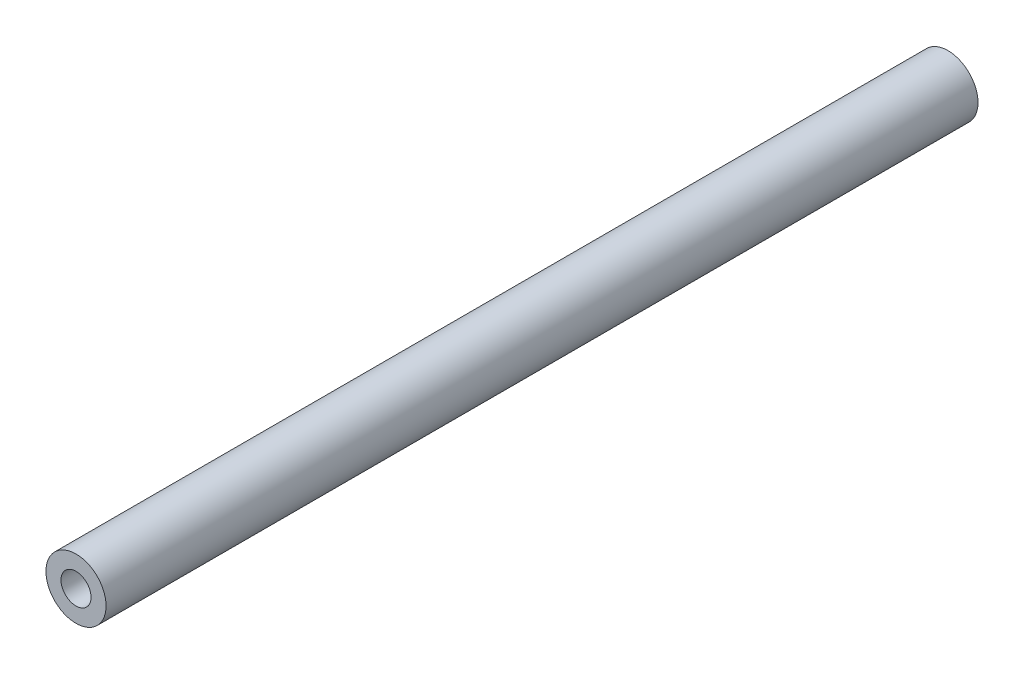
ISO-10303-21;
HEADER;
FILE_DESCRIPTION(('STEP AP214'),'2;1');
FILE_NAME('part.step','',(''),(''),'','','');
FILE_SCHEMA(('AUTOMOTIVE_DESIGN { 1 0 10303 214 1 1 1 1 }'));
ENDSEC;
DATA;
#1=APPLICATION_CONTEXT('core data for automotive mechanical design processes');
#2=APPLICATION_PROTOCOL_DEFINITION('international standard','automotive_design',2000,#1);
#3=PRODUCT_CONTEXT('',#1,'mechanical');
#4=PRODUCT('Part','Part','',(#3));
#5=PRODUCT_RELATED_PRODUCT_CATEGORY('part','',(#4));
#6=PRODUCT_DEFINITION_FORMATION('','',#4);
#7=PRODUCT_DEFINITION_CONTEXT('part definition',#1,'design');
#8=PRODUCT_DEFINITION('design','',#6,#7);
#9=PRODUCT_DEFINITION_SHAPE('','',#8);
#10=(LENGTH_UNIT() NAMED_UNIT(*) SI_UNIT(.MILLI.,.METRE.));
#11=(NAMED_UNIT(*) PLANE_ANGLE_UNIT() SI_UNIT($,.RADIAN.));
#12=(NAMED_UNIT(*) SI_UNIT($,.STERADIAN.) SOLID_ANGLE_UNIT());
#13=UNCERTAINTY_MEASURE_WITH_UNIT(LENGTH_MEASURE(1.E-05),#10,'distance_accuracy_value','');
#14=(GEOMETRIC_REPRESENTATION_CONTEXT(3) GLOBAL_UNCERTAINTY_ASSIGNED_CONTEXT((#13)) GLOBAL_UNIT_ASSIGNED_CONTEXT((#10,
#11,#12)) REPRESENTATION_CONTEXT('',''));
#15=CARTESIAN_POINT('',(0.,0.,0.));
#16=DIRECTION('',(0.,0.,1.));
#17=DIRECTION('',(1.,0.,0.));
#18=AXIS2_PLACEMENT_3D('',#15,#16,#17);
#19=CARTESIAN_POINT('',(0.,0.,290.));
#20=DIRECTION('',(0.,0.,1.));
#21=DIRECTION('',(1.,0.,0.));
#22=AXIS2_PLACEMENT_3D('',#19,#20,#21);
#23=PLANE('',#22);
#24=CARTESIAN_POINT('',(0.,0.,290.));
#25=DIRECTION('',(0.,0.,1.));
#26=DIRECTION('',(1.,0.,0.));
#27=AXIS2_PLACEMENT_3D('',#24,#25,#26);
#28=CIRCLE('',#27,10.);
#29=CARTESIAN_POINT('',(10.,0.,290.));
#30=VERTEX_POINT('',#29);
#31=EDGE_CURVE('E10',#30,#30,#28,.T.);
#32=ORIENTED_EDGE('',*,*,#31,.T.);
#33=EDGE_LOOP('',(#32));
#34=FACE_BOUND('',#33,.T.);
#35=CARTESIAN_POINT('',(0.,0.,290.));
#36=DIRECTION('',(0.,0.,1.));
#37=DIRECTION('',(1.,0.,0.));
#38=AXIS2_PLACEMENT_3D('',#35,#36,#37);
#39=CIRCLE('',#38,5.);
#40=CARTESIAN_POINT('',(5.,0.,290.));
#41=VERTEX_POINT('',#40);
#42=EDGE_CURVE('E48',#41,#41,#39,.T.);
#43=ORIENTED_EDGE('',*,*,#42,.F.);
#44=EDGE_LOOP('',(#43));
#45=FACE_BOUND('',#44,.T.);
#46=ADVANCED_FACE('F35',(#34,#45),#23,.T.);
#47=CARTESIAN_POINT('',(0.,0.,0.));
#48=DIRECTION('',(0.,0.,1.));
#49=DIRECTION('',(1.,0.,0.));
#50=AXIS2_PLACEMENT_3D('',#47,#48,#49);
#51=PLANE('',#50);
#52=CARTESIAN_POINT('',(0.,0.,0.));
#53=DIRECTION('',(0.,0.,1.));
#54=DIRECTION('',(1.,0.,0.));
#55=AXIS2_PLACEMENT_3D('',#52,#53,#54);
#56=CIRCLE('',#55,10.);
#57=CARTESIAN_POINT('',(10.,0.,0.));
#58=VERTEX_POINT('',#57);
#59=EDGE_CURVE('E39',#58,#58,#56,.T.);
#60=ORIENTED_EDGE('',*,*,#59,.F.);
#61=EDGE_LOOP('',(#60));
#62=FACE_BOUND('',#61,.T.);
#63=CARTESIAN_POINT('',(0.,0.,0.));
#64=DIRECTION('',(0.,0.,1.));
#65=DIRECTION('',(1.,0.,0.));
#66=AXIS2_PLACEMENT_3D('',#63,#64,#65);
#67=CIRCLE('',#66,5.);
#68=CARTESIAN_POINT('',(5.,0.,0.));
#69=VERTEX_POINT('',#68);
#70=EDGE_CURVE('E50',#69,#69,#67,.T.);
#71=ORIENTED_EDGE('',*,*,#70,.T.);
#72=EDGE_LOOP('',(#71));
#73=FACE_BOUND('',#72,.T.);
#74=ADVANCED_FACE('F62',(#62,#73),#51,.F.);
#75=CARTESIAN_POINT('',(0.,0.,290.));
#76=DIRECTION('',(0.,0.,-1.));
#77=DIRECTION('',(-1.,0.,0.));
#78=AXIS2_PLACEMENT_3D('',#75,#76,#77);
#79=CYLINDRICAL_SURFACE('',#78,10.);
#80=ORIENTED_EDGE('',*,*,#31,.F.);
#81=EDGE_LOOP('',(#80));
#82=FACE_BOUND('',#81,.T.);
#83=ORIENTED_EDGE('',*,*,#59,.T.);
#84=EDGE_LOOP('',(#83));
#85=FACE_BOUND('',#84,.T.);
#86=ADVANCED_FACE('F37',(#82,#85),#79,.T.);
#87=CARTESIAN_POINT('',(0.,0.,290.));
#88=DIRECTION('',(0.,0.,-1.));
#89=DIRECTION('',(-1.,0.,0.));
#90=AXIS2_PLACEMENT_3D('',#87,#88,#89);
#91=CYLINDRICAL_SURFACE('',#90,5.);
#92=ORIENTED_EDGE('',*,*,#42,.T.);
#93=EDGE_LOOP('',(#92));
#94=FACE_BOUND('',#93,.T.);
#95=ORIENTED_EDGE('',*,*,#70,.F.);
#96=EDGE_LOOP('',(#95));
#97=FACE_BOUND('',#96,.T.);
#98=ADVANCED_FACE('F58',(#94,#97),#91,.F.);
#99=CLOSED_SHELL('',(#46,#74,#86,#98));
#100=MANIFOLD_SOLID_BREP('B2',#99);
#101=ADVANCED_BREP_SHAPE_REPRESENTATION('',(#18,#100),#14);
#102=SHAPE_DEFINITION_REPRESENTATION(#9,#101);
ENDSEC;
END-ISO-10303-21;
